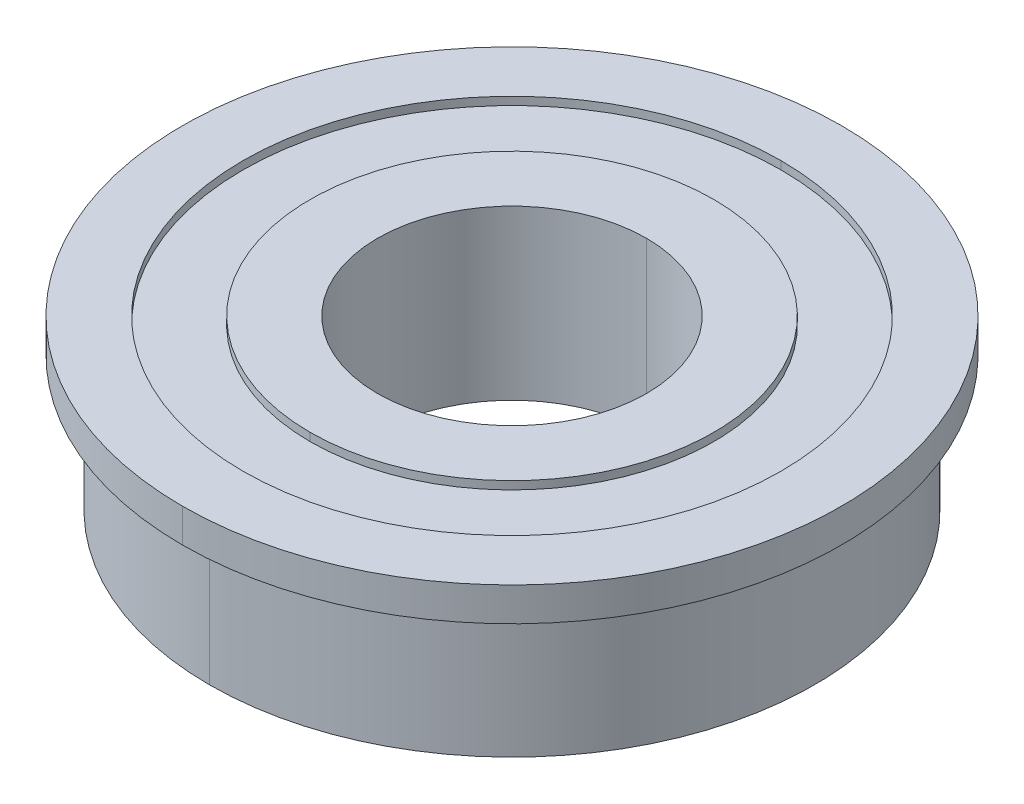
ISO-10303-21;
HEADER;
FILE_DESCRIPTION(('STEP AP214'),'2;1');
FILE_NAME('part.step','',(''),(''),'','','');
FILE_SCHEMA(('AUTOMOTIVE_DESIGN { 1 0 10303 214 1 1 1 1 }'));
ENDSEC;
DATA;
#1=APPLICATION_CONTEXT('core data for automotive mechanical design processes');
#2=APPLICATION_PROTOCOL_DEFINITION('international standard','automotive_design',2000,#1);
#3=PRODUCT_CONTEXT('',#1,'mechanical');
#4=PRODUCT('Part','Part','',(#3));
#5=PRODUCT_RELATED_PRODUCT_CATEGORY('part','',(#4));
#6=PRODUCT_DEFINITION_FORMATION('','',#4);
#7=PRODUCT_DEFINITION_CONTEXT('part definition',#1,'design');
#8=PRODUCT_DEFINITION('design','',#6,#7);
#9=PRODUCT_DEFINITION_SHAPE('','',#8);
#10=(LENGTH_UNIT() NAMED_UNIT(*) SI_UNIT(.MILLI.,.METRE.));
#11=(NAMED_UNIT(*) PLANE_ANGLE_UNIT() SI_UNIT($,.RADIAN.));
#12=(NAMED_UNIT(*) SI_UNIT($,.STERADIAN.) SOLID_ANGLE_UNIT());
#13=UNCERTAINTY_MEASURE_WITH_UNIT(LENGTH_MEASURE(1.E-05),#10,'distance_accuracy_value','');
#14=(GEOMETRIC_REPRESENTATION_CONTEXT(3) GLOBAL_UNCERTAINTY_ASSIGNED_CONTEXT((#13)) GLOBAL_UNIT_ASSIGNED_CONTEXT((#10,
#11,#12)) REPRESENTATION_CONTEXT('',''));
#15=CARTESIAN_POINT('',(0.,0.,0.));
#16=DIRECTION('',(0.,0.,1.));
#17=DIRECTION('',(1.,0.,0.));
#18=AXIS2_PLACEMENT_3D('',#15,#16,#17);
#19=CARTESIAN_POINT('',(0.,0.,0.));
#20=DIRECTION('',(0.,1.,0.));
#21=DIRECTION('',(0.,0.,1.));
#22=AXIS2_PLACEMENT_3D('',#19,#20,#21);
#23=CYLINDRICAL_SURFACE('',#22,12.7);
#24=DIRECTION('',(0.,1.,0.));
#25=VECTOR('',#24,1.);
#26=CARTESIAN_POINT('',(0.,0.,-12.7));
#27=LINE('',#26,#25);
#28=CARTESIAN_POINT('',(0.,7.5565,-12.7));
#29=VERTEX_POINT('',#28);
#30=CARTESIAN_POINT('',(0.,7.9375,-12.7));
#31=VERTEX_POINT('',#30);
#32=EDGE_CURVE('E176',#29,#31,#27,.T.);
#33=ORIENTED_EDGE('',*,*,#32,.F.);
#34=CARTESIAN_POINT('',(0.,7.5565,0.));
#35=DIRECTION('',(0.,1.,0.));
#36=DIRECTION('',(0.,0.,1.));
#37=AXIS2_PLACEMENT_3D('',#34,#35,#36);
#38=CIRCLE('',#37,12.7);
#39=CARTESIAN_POINT('',(0.,7.5565,12.7));
#40=VERTEX_POINT('',#39);
#41=EDGE_CURVE('E11',#40,#29,#38,.T.);
#42=ORIENTED_EDGE('',*,*,#41,.F.);
#43=DIRECTION('',(0.,1.,0.));
#44=VECTOR('',#43,1.);
#45=CARTESIAN_POINT('',(0.,0.,12.7));
#46=LINE('',#45,#44);
#47=CARTESIAN_POINT('',(0.,7.9375,12.7));
#48=VERTEX_POINT('',#47);
#49=EDGE_CURVE('E157',#40,#48,#46,.T.);
#50=ORIENTED_EDGE('',*,*,#49,.T.);
#51=CARTESIAN_POINT('',(0.,7.9375,0.));
#52=DIRECTION('',(0.,-1.,0.));
#53=DIRECTION('',(0.,0.,1.));
#54=AXIS2_PLACEMENT_3D('',#51,#52,#53);
#55=CIRCLE('',#54,12.7);
#56=EDGE_CURVE('E27',#31,#48,#55,.T.);
#57=ORIENTED_EDGE('',*,*,#56,.F.);
#58=EDGE_LOOP('',(#33,#42,#50,#57));
#59=FACE_BOUND('',#58,.T.);
#60=ADVANCED_FACE('F16',(#59),#23,.F.);
#61=CARTESIAN_POINT('',(9.525,7.5565,0.));
#62=DIRECTION('',(0.,1.,0.));
#63=DIRECTION('',(1.,0.,0.));
#64=AXIS2_PLACEMENT_3D('',#61,#62,#63);
#65=PLANE('',#64);
#66=CARTESIAN_POINT('',(0.,7.5565,0.));
#67=DIRECTION('',(0.,1.,0.));
#68=DIRECTION('',(0.,0.,1.));
#69=AXIS2_PLACEMENT_3D('',#66,#67,#68);
#70=CIRCLE('',#69,9.525);
#71=CARTESIAN_POINT('',(0.,7.5565,9.525));
#72=VERTEX_POINT('',#71);
#73=CARTESIAN_POINT('',(0.,7.5565,-9.525));
#74=VERTEX_POINT('',#73);
#75=EDGE_CURVE('E150',#72,#74,#70,.T.);
#76=ORIENTED_EDGE('',*,*,#75,.F.);
#77=CARTESIAN_POINT('',(0.,7.5565,0.));
#78=DIRECTION('',(0.,1.,0.));
#79=DIRECTION('',(0.,0.,1.));
#80=AXIS2_PLACEMENT_3D('',#77,#78,#79);
#81=CIRCLE('',#80,9.525);
#82=EDGE_CURVE('E135',#74,#72,#81,.T.);
#83=ORIENTED_EDGE('',*,*,#82,.F.);
#84=EDGE_LOOP('',(#76,#83));
#85=FACE_BOUND('',#84,.T.);
#86=ORIENTED_EDGE('',*,*,#41,.T.);
#87=CARTESIAN_POINT('',(0.,7.5565,0.));
#88=DIRECTION('',(0.,1.,0.));
#89=DIRECTION('',(0.,0.,1.));
#90=AXIS2_PLACEMENT_3D('',#87,#88,#89);
#91=CIRCLE('',#90,12.7);
#92=EDGE_CURVE('E140',#29,#40,#91,.T.);
#93=ORIENTED_EDGE('',*,*,#92,.T.);
#94=EDGE_LOOP('',(#86,#93));
#95=FACE_BOUND('',#94,.T.);
#96=ADVANCED_FACE('F262',(#85,#95),#65,.T.);
#97=CARTESIAN_POINT('',(12.7,7.9375,0.));
#98=DIRECTION('',(0.,1.,0.));
#99=DIRECTION('',(1.,0.,0.));
#100=AXIS2_PLACEMENT_3D('',#97,#98,#99);
#101=PLANE('',#100);
#102=CARTESIAN_POINT('',(0.,7.9375,0.));
#103=DIRECTION('',(0.,-1.,0.));
#104=DIRECTION('',(0.,0.,1.));
#105=AXIS2_PLACEMENT_3D('',#102,#103,#104);
#106=CIRCLE('',#105,12.7);
#107=EDGE_CURVE('E168',#48,#31,#106,.T.);
#108=ORIENTED_EDGE('',*,*,#107,.T.);
#109=ORIENTED_EDGE('',*,*,#56,.T.);
#110=EDGE_LOOP('',(#108,#109));
#111=FACE_BOUND('',#110,.T.);
#112=CARTESIAN_POINT('',(0.,7.9375,0.));
#113=DIRECTION('',(0.,-1.,0.));
#114=DIRECTION('',(0.,0.,1.));
#115=AXIS2_PLACEMENT_3D('',#112,#113,#114);
#116=CIRCLE('',#115,15.5575);
#117=CARTESIAN_POINT('',(0.,7.9375,15.5575));
#118=VERTEX_POINT('',#117);
#119=CARTESIAN_POINT('',(0.,7.9375,-15.5575));
#120=VERTEX_POINT('',#119);
#121=EDGE_CURVE('E130',#118,#120,#116,.T.);
#122=ORIENTED_EDGE('',*,*,#121,.F.);
#123=CARTESIAN_POINT('',(0.,7.9375,0.));
#124=DIRECTION('',(0.,-1.,0.));
#125=DIRECTION('',(0.,0.,1.));
#126=AXIS2_PLACEMENT_3D('',#123,#124,#125);
#127=CIRCLE('',#126,15.5575);
#128=EDGE_CURVE('E190',#120,#118,#127,.T.);
#129=ORIENTED_EDGE('',*,*,#128,.F.);
#130=EDGE_LOOP('',(#122,#129));
#131=FACE_BOUND('',#130,.T.);
#132=ADVANCED_FACE('F267',(#111,#131),#101,.T.);
#133=CARTESIAN_POINT('',(0.,0.,0.));
#134=DIRECTION('',(0.,1.,0.));
#135=DIRECTION('',(0.,0.,1.));
#136=AXIS2_PLACEMENT_3D('',#133,#134,#135);
#137=CYLINDRICAL_SURFACE('',#136,9.525);
#138=DIRECTION('',(0.,1.,0.));
#139=VECTOR('',#138,1.);
#140=CARTESIAN_POINT('',(0.,0.,-9.525));
#141=LINE('',#140,#139);
#142=CARTESIAN_POINT('',(0.,7.9375,-9.525));
#143=VERTEX_POINT('',#142);
#144=EDGE_CURVE('E143',#74,#143,#141,.T.);
#145=ORIENTED_EDGE('',*,*,#144,.F.);
#146=ORIENTED_EDGE('',*,*,#82,.T.);
#147=DIRECTION('',(0.,1.,0.));
#148=VECTOR('',#147,1.);
#149=CARTESIAN_POINT('',(0.,0.,9.525));
#150=LINE('',#149,#148);
#151=CARTESIAN_POINT('',(0.,7.9375,9.525));
#152=VERTEX_POINT('',#151);
#153=EDGE_CURVE('E134',#72,#152,#150,.T.);
#154=ORIENTED_EDGE('',*,*,#153,.T.);
#155=CARTESIAN_POINT('',(0.,7.9375,0.));
#156=DIRECTION('',(0.,1.,0.));
#157=DIRECTION('',(0.,0.,1.));
#158=AXIS2_PLACEMENT_3D('',#155,#156,#157);
#159=CIRCLE('',#158,9.525);
#160=EDGE_CURVE('E121',#143,#152,#159,.T.);
#161=ORIENTED_EDGE('',*,*,#160,.F.);
#162=EDGE_LOOP('',(#145,#146,#154,#161));
#163=FACE_BOUND('',#162,.T.);
#164=ADVANCED_FACE('F18',(#163),#137,.T.);
#165=CARTESIAN_POINT('',(0.,0.,0.));
#166=DIRECTION('',(0.,1.,0.));
#167=DIRECTION('',(0.,0.,1.));
#168=AXIS2_PLACEMENT_3D('',#165,#166,#167);
#169=CYLINDRICAL_SURFACE('',#168,15.5575);
#170=DIRECTION('',(0.,1.,0.));
#171=VECTOR('',#170,1.);
#172=CARTESIAN_POINT('',(0.,0.,-15.5575));
#173=LINE('',#172,#171);
#174=CARTESIAN_POINT('',(0.,6.35,-15.5575));
#175=VERTEX_POINT('',#174);
#176=EDGE_CURVE('E186',#175,#120,#173,.T.);
#177=ORIENTED_EDGE('',*,*,#176,.F.);
#178=CARTESIAN_POINT('',(0.,6.35,0.));
#179=DIRECTION('',(0.,-1.,0.));
#180=DIRECTION('',(0.,0.,1.));
#181=AXIS2_PLACEMENT_3D('',#178,#179,#180);
#182=CIRCLE('',#181,15.5575);
#183=CARTESIAN_POINT('',(0.,6.35,15.5575));
#184=VERTEX_POINT('',#183);
#185=EDGE_CURVE('E131',#184,#175,#182,.T.);
#186=ORIENTED_EDGE('',*,*,#185,.F.);
#187=DIRECTION('',(0.,1.,0.));
#188=VECTOR('',#187,1.);
#189=CARTESIAN_POINT('',(0.,0.,15.5575));
#190=LINE('',#189,#188);
#191=EDGE_CURVE('E217',#184,#118,#190,.T.);
#192=ORIENTED_EDGE('',*,*,#191,.T.);
#193=ORIENTED_EDGE('',*,*,#121,.T.);
#194=EDGE_LOOP('',(#177,#186,#192,#193));
#195=FACE_BOUND('',#194,.T.);
#196=ADVANCED_FACE('F409',(#195),#169,.T.);
#197=CARTESIAN_POINT('',(6.35,7.9375,0.));
#198=DIRECTION('',(0.,1.,0.));
#199=DIRECTION('',(1.,0.,0.));
#200=AXIS2_PLACEMENT_3D('',#197,#198,#199);
#201=PLANE('',#200);
#202=CARTESIAN_POINT('',(0.,7.9375,0.));
#203=DIRECTION('',(0.,-1.,0.));
#204=DIRECTION('',(0.,0.,1.));
#205=AXIS2_PLACEMENT_3D('',#202,#203,#204);
#206=CIRCLE('',#205,6.35);
#207=CARTESIAN_POINT('',(0.,7.9375,6.35));
#208=VERTEX_POINT('',#207);
#209=CARTESIAN_POINT('',(0.,7.9375,-6.35));
#210=VERTEX_POINT('',#209);
#211=EDGE_CURVE('E199',#208,#210,#206,.T.);
#212=ORIENTED_EDGE('',*,*,#211,.T.);
#213=CARTESIAN_POINT('',(0.,7.9375,0.));
#214=DIRECTION('',(0.,-1.,0.));
#215=DIRECTION('',(0.,0.,1.));
#216=AXIS2_PLACEMENT_3D('',#213,#214,#215);
#217=CIRCLE('',#216,6.35);
#218=EDGE_CURVE('E99',#210,#208,#217,.T.);
#219=ORIENTED_EDGE('',*,*,#218,.T.);
#220=EDGE_LOOP('',(#212,#219));
#221=FACE_BOUND('',#220,.T.);
#222=CARTESIAN_POINT('',(0.,7.9375,0.));
#223=DIRECTION('',(0.,1.,0.));
#224=DIRECTION('',(0.,0.,1.));
#225=AXIS2_PLACEMENT_3D('',#222,#223,#224);
#226=CIRCLE('',#225,9.525);
#227=EDGE_CURVE('E125',#152,#143,#226,.T.);
#228=ORIENTED_EDGE('',*,*,#227,.T.);
#229=ORIENTED_EDGE('',*,*,#160,.T.);
#230=EDGE_LOOP('',(#228,#229));
#231=FACE_BOUND('',#230,.T.);
#232=ADVANCED_FACE('F123',(#221,#231),#201,.T.);
#233=CARTESIAN_POINT('',(15.5575,6.35,0.));
#234=DIRECTION('',(0.,-1.,0.));
#235=DIRECTION('',(0.,0.,-1.));
#236=AXIS2_PLACEMENT_3D('',#233,#234,#235);
#237=PLANE('',#236);
#238=CARTESIAN_POINT('',(0.,6.35,0.));
#239=DIRECTION('',(0.,-1.,0.));
#240=DIRECTION('',(0.,0.,1.));
#241=AXIS2_PLACEMENT_3D('',#238,#239,#240);
#242=CIRCLE('',#241,14.2875);
#243=CARTESIAN_POINT('',(0.,6.35,14.2875));
#244=VERTEX_POINT('',#243);
#245=CARTESIAN_POINT('',(0.,6.35,-14.2875));
#246=VERTEX_POINT('',#245);
#247=EDGE_CURVE('E166',#244,#246,#242,.T.);
#248=ORIENTED_EDGE('',*,*,#247,.F.);
#249=CARTESIAN_POINT('',(0.,6.35,0.));
#250=DIRECTION('',(0.,-1.,0.));
#251=DIRECTION('',(0.,0.,1.));
#252=AXIS2_PLACEMENT_3D('',#249,#250,#251);
#253=CIRCLE('',#252,14.2875);
#254=EDGE_CURVE('E227',#246,#244,#253,.T.);
#255=ORIENTED_EDGE('',*,*,#254,.F.);
#256=EDGE_LOOP('',(#248,#255));
#257=FACE_BOUND('',#256,.T.);
#258=ORIENTED_EDGE('',*,*,#185,.T.);
#259=CARTESIAN_POINT('',(0.,6.35,0.));
#260=DIRECTION('',(0.,-1.,0.));
#261=DIRECTION('',(0.,0.,1.));
#262=AXIS2_PLACEMENT_3D('',#259,#260,#261);
#263=CIRCLE('',#262,15.5575);
#264=EDGE_CURVE('E191',#175,#184,#263,.T.);
#265=ORIENTED_EDGE('',*,*,#264,.T.);
#266=EDGE_LOOP('',(#258,#265));
#267=FACE_BOUND('',#266,.T.);
#268=ADVANCED_FACE('F248',(#257,#267),#237,.T.);
#269=CARTESIAN_POINT('',(0.,0.,0.));
#270=DIRECTION('',(0.,1.,0.));
#271=DIRECTION('',(0.,0.,1.));
#272=AXIS2_PLACEMENT_3D('',#269,#270,#271);
#273=CYLINDRICAL_SURFACE('',#272,6.35);
#274=DIRECTION('',(0.,1.,0.));
#275=VECTOR('',#274,1.);
#276=CARTESIAN_POINT('',(0.,0.,-6.35));
#277=LINE('',#276,#275);
#278=CARTESIAN_POINT('',(0.,0.,-6.35));
#279=VERTEX_POINT('',#278);
#280=EDGE_CURVE('E213',#279,#210,#277,.T.);
#281=ORIENTED_EDGE('',*,*,#280,.F.);
#282=CARTESIAN_POINT('',(0.,0.,0.));
#283=DIRECTION('',(0.,1.,0.));
#284=DIRECTION('',(0.,0.,1.));
#285=AXIS2_PLACEMENT_3D('',#282,#283,#284);
#286=CIRCLE('',#285,6.35);
#287=CARTESIAN_POINT('',(0.,0.,6.35));
#288=VERTEX_POINT('',#287);
#289=EDGE_CURVE('E156',#288,#279,#286,.T.);
#290=ORIENTED_EDGE('',*,*,#289,.F.);
#291=DIRECTION('',(0.,1.,0.));
#292=VECTOR('',#291,1.);
#293=CARTESIAN_POINT('',(0.,0.,6.35));
#294=LINE('',#293,#292);
#295=EDGE_CURVE('E197',#288,#208,#294,.T.);
#296=ORIENTED_EDGE('',*,*,#295,.T.);
#297=ORIENTED_EDGE('',*,*,#218,.F.);
#298=EDGE_LOOP('',(#281,#290,#296,#297));
#299=FACE_BOUND('',#298,.T.);
#300=ADVANCED_FACE('F245',(#299),#273,.F.);
#301=CARTESIAN_POINT('',(0.,0.,0.));
#302=DIRECTION('',(0.,1.,0.));
#303=DIRECTION('',(0.,0.,1.));
#304=AXIS2_PLACEMENT_3D('',#301,#302,#303);
#305=CYLINDRICAL_SURFACE('',#304,14.2875);
#306=DIRECTION('',(0.,1.,0.));
#307=VECTOR('',#306,1.);
#308=CARTESIAN_POINT('',(0.,0.,-14.2875));
#309=LINE('',#308,#307);
#310=CARTESIAN_POINT('',(0.,0.,-14.2875));
#311=VERTEX_POINT('',#310);
#312=EDGE_CURVE('E20',#311,#246,#309,.T.);
#313=ORIENTED_EDGE('',*,*,#312,.F.);
#314=CARTESIAN_POINT('',(0.,0.,0.));
#315=DIRECTION('',(0.,-1.,0.));
#316=DIRECTION('',(0.,0.,1.));
#317=AXIS2_PLACEMENT_3D('',#314,#315,#316);
#318=CIRCLE('',#317,14.2875);
#319=CARTESIAN_POINT('',(0.,0.,14.2875));
#320=VERTEX_POINT('',#319);
#321=EDGE_CURVE('E154',#320,#311,#318,.T.);
#322=ORIENTED_EDGE('',*,*,#321,.F.);
#323=DIRECTION('',(0.,1.,0.));
#324=VECTOR('',#323,1.);
#325=CARTESIAN_POINT('',(0.,0.,14.2875));
#326=LINE('',#325,#324);
#327=EDGE_CURVE('E223',#320,#244,#326,.T.);
#328=ORIENTED_EDGE('',*,*,#327,.T.);
#329=ORIENTED_EDGE('',*,*,#247,.T.);
#330=EDGE_LOOP('',(#313,#322,#328,#329));
#331=FACE_BOUND('',#330,.T.);
#332=ADVANCED_FACE('F247',(#331),#305,.T.);
#333=CARTESIAN_POINT('',(14.2875,0.,0.));
#334=DIRECTION('',(0.,-1.,0.));
#335=DIRECTION('',(0.,0.,-1.));
#336=AXIS2_PLACEMENT_3D('',#333,#334,#335);
#337=PLANE('',#336);
#338=ORIENTED_EDGE('',*,*,#289,.T.);
#339=CARTESIAN_POINT('',(0.,0.,0.));
#340=DIRECTION('',(0.,1.,0.));
#341=DIRECTION('',(0.,0.,1.));
#342=AXIS2_PLACEMENT_3D('',#339,#340,#341);
#343=CIRCLE('',#342,6.35);
#344=EDGE_CURVE('E180',#279,#288,#343,.T.);
#345=ORIENTED_EDGE('',*,*,#344,.T.);
#346=EDGE_LOOP('',(#338,#345));
#347=FACE_BOUND('',#346,.T.);
#348=ORIENTED_EDGE('',*,*,#321,.T.);
#349=CARTESIAN_POINT('',(0.,0.,0.));
#350=DIRECTION('',(0.,-1.,0.));
#351=DIRECTION('',(0.,0.,1.));
#352=AXIS2_PLACEMENT_3D('',#349,#350,#351);
#353=CIRCLE('',#352,14.2875);
#354=EDGE_CURVE('E194',#311,#320,#353,.T.);
#355=ORIENTED_EDGE('',*,*,#354,.T.);
#356=EDGE_LOOP('',(#348,#355));
#357=FACE_BOUND('',#356,.T.);
#358=ADVANCED_FACE('F242',(#347,#357),#337,.T.);
#359=CARTESIAN_POINT('',(0.,0.,0.));
#360=DIRECTION('',(0.,1.,0.));
#361=DIRECTION('',(0.,0.,1.));
#362=AXIS2_PLACEMENT_3D('',#359,#360,#361);
#363=CYLINDRICAL_SURFACE('',#362,12.7);
#364=ORIENTED_EDGE('',*,*,#92,.F.);
#365=ORIENTED_EDGE('',*,*,#32,.T.);
#366=ORIENTED_EDGE('',*,*,#107,.F.);
#367=ORIENTED_EDGE('',*,*,#49,.F.);
#368=EDGE_LOOP('',(#364,#365,#366,#367));
#369=FACE_BOUND('',#368,.T.);
#370=ADVANCED_FACE('F429',(#369),#363,.F.);
#371=CARTESIAN_POINT('',(0.,0.,0.));
#372=DIRECTION('',(0.,1.,0.));
#373=DIRECTION('',(0.,0.,1.));
#374=AXIS2_PLACEMENT_3D('',#371,#372,#373);
#375=CYLINDRICAL_SURFACE('',#374,9.525);
#376=ORIENTED_EDGE('',*,*,#75,.T.);
#377=ORIENTED_EDGE('',*,*,#144,.T.);
#378=ORIENTED_EDGE('',*,*,#227,.F.);
#379=ORIENTED_EDGE('',*,*,#153,.F.);
#380=EDGE_LOOP('',(#376,#377,#378,#379));
#381=FACE_BOUND('',#380,.T.);
#382=ADVANCED_FACE('F142',(#381),#375,.T.);
#383=CARTESIAN_POINT('',(0.,0.,0.));
#384=DIRECTION('',(0.,1.,0.));
#385=DIRECTION('',(0.,0.,1.));
#386=AXIS2_PLACEMENT_3D('',#383,#384,#385);
#387=CYLINDRICAL_SURFACE('',#386,15.5575);
#388=ORIENTED_EDGE('',*,*,#264,.F.);
#389=ORIENTED_EDGE('',*,*,#176,.T.);
#390=ORIENTED_EDGE('',*,*,#128,.T.);
#391=ORIENTED_EDGE('',*,*,#191,.F.);
#392=EDGE_LOOP('',(#388,#389,#390,#391));
#393=FACE_BOUND('',#392,.T.);
#394=ADVANCED_FACE('F278',(#393),#387,.T.);
#395=CARTESIAN_POINT('',(0.,0.,0.));
#396=DIRECTION('',(0.,1.,0.));
#397=DIRECTION('',(0.,0.,1.));
#398=AXIS2_PLACEMENT_3D('',#395,#396,#397);
#399=CYLINDRICAL_SURFACE('',#398,6.35);
#400=ORIENTED_EDGE('',*,*,#344,.F.);
#401=ORIENTED_EDGE('',*,*,#280,.T.);
#402=ORIENTED_EDGE('',*,*,#211,.F.);
#403=ORIENTED_EDGE('',*,*,#295,.F.);
#404=EDGE_LOOP('',(#400,#401,#402,#403));
#405=FACE_BOUND('',#404,.T.);
#406=ADVANCED_FACE('F244',(#405),#399,.F.);
#407=CARTESIAN_POINT('',(0.,0.,0.));
#408=DIRECTION('',(0.,1.,0.));
#409=DIRECTION('',(0.,0.,1.));
#410=AXIS2_PLACEMENT_3D('',#407,#408,#409);
#411=CYLINDRICAL_SURFACE('',#410,14.2875);
#412=ORIENTED_EDGE('',*,*,#354,.F.);
#413=ORIENTED_EDGE('',*,*,#312,.T.);
#414=ORIENTED_EDGE('',*,*,#254,.T.);
#415=ORIENTED_EDGE('',*,*,#327,.F.);
#416=EDGE_LOOP('',(#412,#413,#414,#415));
#417=FACE_BOUND('',#416,.T.);
#418=ADVANCED_FACE('F272',(#417),#411,.T.);
#419=CLOSED_SHELL('',(#60,#96,#132,#164,#196,#232,#268,#300,#332,#358,#370,#382,#394,#406,#418));
#420=MANIFOLD_SOLID_BREP('B1',#419);
#421=ADVANCED_BREP_SHAPE_REPRESENTATION('',(#18,#420),#14);
#422=SHAPE_DEFINITION_REPRESENTATION(#9,#421);
ENDSEC;
END-ISO-10303-21;
